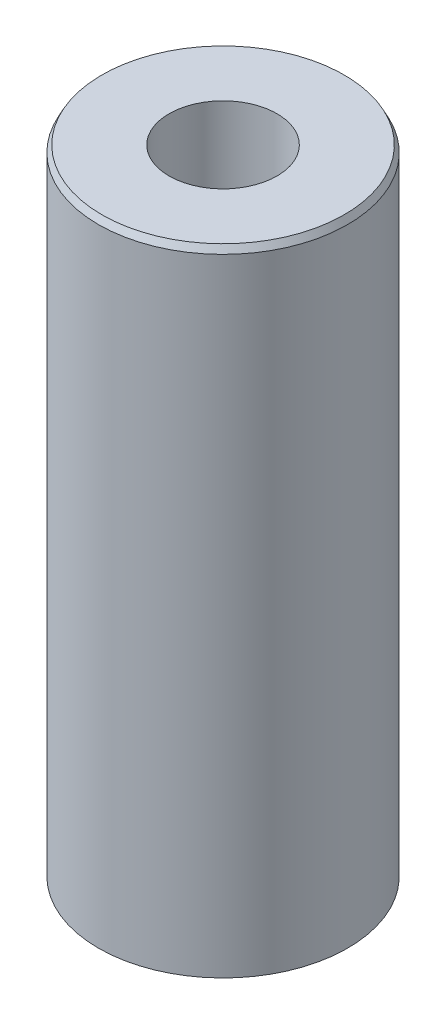
ISO-10303-21;
HEADER;
FILE_DESCRIPTION(('STEP AP214'),'2;1');
FILE_NAME('part.step','',(''),(''),'','','');
FILE_SCHEMA(('AUTOMOTIVE_DESIGN { 1 0 10303 214 1 1 1 1 }'));
ENDSEC;
DATA;
#1=APPLICATION_CONTEXT('core data for automotive mechanical design processes');
#2=APPLICATION_PROTOCOL_DEFINITION('international standard','automotive_design',2000,#1);
#3=PRODUCT_CONTEXT('',#1,'mechanical');
#4=PRODUCT('Part','Part','',(#3));
#5=PRODUCT_RELATED_PRODUCT_CATEGORY('part','',(#4));
#6=PRODUCT_DEFINITION_FORMATION('','',#4);
#7=PRODUCT_DEFINITION_CONTEXT('part definition',#1,'design');
#8=PRODUCT_DEFINITION('design','',#6,#7);
#9=PRODUCT_DEFINITION_SHAPE('','',#8);
#10=(LENGTH_UNIT() NAMED_UNIT(*) SI_UNIT(.MILLI.,.METRE.));
#11=(NAMED_UNIT(*) PLANE_ANGLE_UNIT() SI_UNIT($,.RADIAN.));
#12=(NAMED_UNIT(*) SI_UNIT($,.STERADIAN.) SOLID_ANGLE_UNIT());
#13=UNCERTAINTY_MEASURE_WITH_UNIT(LENGTH_MEASURE(1.E-05),#10,'distance_accuracy_value','');
#14=(GEOMETRIC_REPRESENTATION_CONTEXT(3) GLOBAL_UNCERTAINTY_ASSIGNED_CONTEXT((#13)) GLOBAL_UNIT_ASSIGNED_CONTEXT((#10,
#11,#12)) REPRESENTATION_CONTEXT('',''));
#15=CARTESIAN_POINT('',(0.,0.,0.));
#16=DIRECTION('',(0.,0.,1.));
#17=DIRECTION('',(1.,0.,0.));
#18=AXIS2_PLACEMENT_3D('',#15,#16,#17);
#19=CARTESIAN_POINT('',(0.,89.4472975035066,0.));
#20=DIRECTION('',(0.,-1.,0.));
#21=DIRECTION('',(0.,0.,-1.));
#22=AXIS2_PLACEMENT_3D('',#19,#20,#21);
#23=CYLINDRICAL_SURFACE('',#22,17.5);
#24=CARTESIAN_POINT('',(0.,88.497919855506,0.));
#25=DIRECTION('',(0.,1.,0.));
#26=DIRECTION('',(0.,0.,1.));
#27=AXIS2_PLACEMENT_3D('',#24,#25,#26);
#28=CIRCLE('',#27,17.5);
#29=CARTESIAN_POINT('',(0.,88.497919855506,17.5));
#30=VERTEX_POINT('',#29);
#31=EDGE_CURVE('E50',#30,#30,#28,.F.);
#32=ORIENTED_EDGE('',*,*,#31,.T.);
#33=EDGE_LOOP('',(#32));
#34=FACE_BOUND('',#33,.T.);
#35=CARTESIAN_POINT('',(0.,0.485647196844574,0.));
#36=DIRECTION('',(0.,1.,0.));
#37=DIRECTION('',(0.,0.,1.));
#38=AXIS2_PLACEMENT_3D('',#35,#36,#37);
#39=CIRCLE('',#38,17.5);
#40=CARTESIAN_POINT('',(0.,0.485647196844574,17.5));
#41=VERTEX_POINT('',#40);
#42=EDGE_CURVE('E51',#41,#41,#39,.T.);
#43=ORIENTED_EDGE('',*,*,#42,.T.);
#44=EDGE_LOOP('',(#43));
#45=FACE_BOUND('',#44,.T.);
#46=ADVANCED_FACE('F39',(#34,#45),#23,.T.);
#47=CARTESIAN_POINT('',(0.,89.4472975035066,0.));
#48=DIRECTION('',(0.,1.,0.));
#49=DIRECTION('',(0.,0.,1.));
#50=AXIS2_PLACEMENT_3D('',#47,#48,#49);
#51=PLANE('',#50);
#52=CARTESIAN_POINT('',(0.,89.4472975035066,0.));
#53=DIRECTION('',(0.,1.,0.));
#54=DIRECTION('',(0.,0.,1.));
#55=AXIS2_PLACEMENT_3D('',#52,#53,#54);
#56=CIRCLE('',#55,17.0143528031554);
#57=CARTESIAN_POINT('',(0.,89.4472975035066,17.0143528031554));
#58=VERTEX_POINT('',#57);
#59=EDGE_CURVE('E54',#58,#58,#56,.T.);
#60=ORIENTED_EDGE('',*,*,#59,.T.);
#61=EDGE_LOOP('',(#60));
#62=FACE_BOUND('',#61,.T.);
#63=CARTESIAN_POINT('',(0.,89.4472975035066,0.));
#64=DIRECTION('',(0.,1.,0.));
#65=DIRECTION('',(0.,0.,1.));
#66=AXIS2_PLACEMENT_3D('',#63,#64,#65);
#67=CIRCLE('',#66,7.58054624078732);
#68=CARTESIAN_POINT('',(0.,89.4472975035066,7.58054624078732));
#69=VERTEX_POINT('',#68);
#70=EDGE_CURVE('E58',#69,#69,#67,.T.);
#71=ORIENTED_EDGE('',*,*,#70,.F.);
#72=EDGE_LOOP('',(#71));
#73=FACE_BOUND('',#72,.T.);
#74=ADVANCED_FACE('F69',(#62,#73),#51,.T.);
#75=CARTESIAN_POINT('',(0.,0.,0.));
#76=DIRECTION('',(0.,1.,0.));
#77=DIRECTION('',(0.,0.,1.));
#78=AXIS2_PLACEMENT_3D('',#75,#76,#77);
#79=PLANE('',#78);
#80=CARTESIAN_POINT('',(0.,0.,0.));
#81=DIRECTION('',(0.,1.,0.));
#82=DIRECTION('',(0.,0.,1.));
#83=AXIS2_PLACEMENT_3D('',#80,#81,#82);
#84=CIRCLE('',#83,16.5506223519994);
#85=CARTESIAN_POINT('',(0.,0.,16.5506223519994));
#86=VERTEX_POINT('',#85);
#87=EDGE_CURVE('E10',#86,#86,#84,.F.);
#88=ORIENTED_EDGE('',*,*,#87,.T.);
#89=EDGE_LOOP('',(#88));
#90=FACE_BOUND('',#89,.T.);
#91=CARTESIAN_POINT('',(0.,0.,0.));
#92=DIRECTION('',(0.,1.,0.));
#93=DIRECTION('',(0.,0.,1.));
#94=AXIS2_PLACEMENT_3D('',#91,#92,#93);
#95=CIRCLE('',#94,7.58054624078732);
#96=CARTESIAN_POINT('',(0.,0.,7.58054624078732));
#97=VERTEX_POINT('',#96);
#98=EDGE_CURVE('E63',#97,#97,#95,.T.);
#99=ORIENTED_EDGE('',*,*,#98,.T.);
#100=EDGE_LOOP('',(#99));
#101=FACE_BOUND('',#100,.T.);
#102=ADVANCED_FACE('F75',(#90,#101),#79,.F.);
#103=CARTESIAN_POINT('',(0.,89.4472975035066,0.));
#104=DIRECTION('',(0.,-1.,0.));
#105=DIRECTION('',(0.,0.,-1.));
#106=AXIS2_PLACEMENT_3D('',#103,#104,#105);
#107=CYLINDRICAL_SURFACE('',#106,7.58054624078732);
#108=ORIENTED_EDGE('',*,*,#70,.T.);
#109=EDGE_LOOP('',(#108));
#110=FACE_BOUND('',#109,.T.);
#111=ORIENTED_EDGE('',*,*,#98,.F.);
#112=EDGE_LOOP('',(#111));
#113=FACE_BOUND('',#112,.T.);
#114=ADVANCED_FACE('F70',(#110,#113),#107,.F.);
#115=CARTESIAN_POINT('',(0.,89.4472975035066,0.));
#116=DIRECTION('',(0.,-1.,0.));
#117=DIRECTION('',(0.,0.,-1.));
#118=AXIS2_PLACEMENT_3D('',#115,#116,#117);
#119=CONICAL_SURFACE('',#118,17.0143528031554,0.472839064115653);
#120=ORIENTED_EDGE('',*,*,#31,.F.);
#121=EDGE_LOOP('',(#120));
#122=FACE_BOUND('',#121,.T.);
#123=ORIENTED_EDGE('',*,*,#59,.F.);
#124=EDGE_LOOP('',(#123));
#125=FACE_BOUND('',#124,.T.);
#126=ADVANCED_FACE('F81',(#122,#125),#119,.T.);
#127=CARTESIAN_POINT('',(0.,0.485647196844574,0.));
#128=DIRECTION('',(0.,1.,0.));
#129=DIRECTION('',(0.,0.,1.));
#130=AXIS2_PLACEMENT_3D('',#127,#128,#129);
#131=CONICAL_SURFACE('',#130,17.5,1.09795726267924);
#132=ORIENTED_EDGE('',*,*,#87,.F.);
#133=EDGE_LOOP('',(#132));
#134=FACE_BOUND('',#133,.T.);
#135=ORIENTED_EDGE('',*,*,#42,.F.);
#136=EDGE_LOOP('',(#135));
#137=FACE_BOUND('',#136,.T.);
#138=ADVANCED_FACE('F45',(#134,#137),#131,.T.);
#139=CLOSED_SHELL('',(#46,#74,#102,#114,#126,#138));
#140=MANIFOLD_SOLID_BREP('B2',#139);
#141=ADVANCED_BREP_SHAPE_REPRESENTATION('',(#18,#140),#14);
#142=SHAPE_DEFINITION_REPRESENTATION(#9,#141);
ENDSEC;
END-ISO-10303-21;
